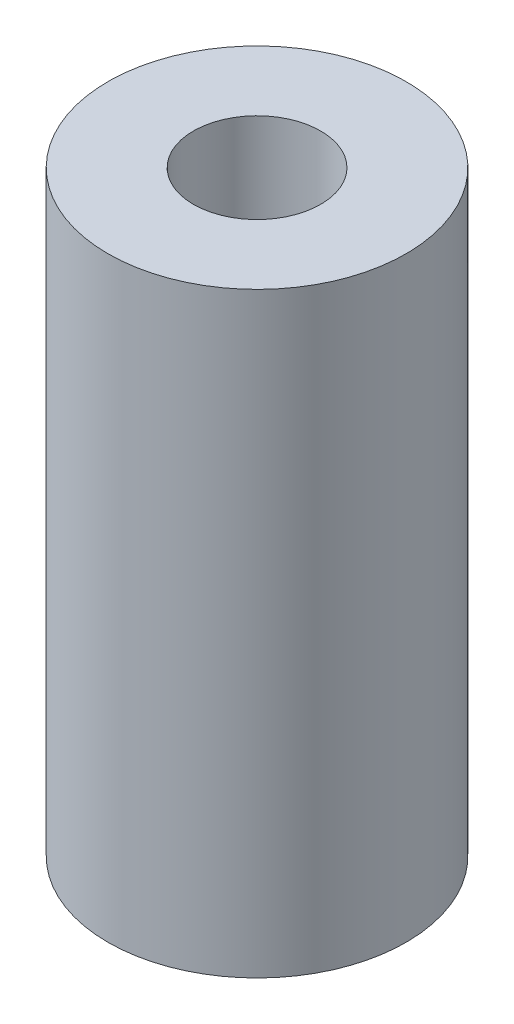
ISO-10303-21;
HEADER;
FILE_DESCRIPTION(('STEP AP214'),'2;1');
FILE_NAME('part.step','',(''),(''),'','','');
FILE_SCHEMA(('AUTOMOTIVE_DESIGN { 1 0 10303 214 1 1 1 1 }'));
ENDSEC;
DATA;
#1=APPLICATION_CONTEXT('core data for automotive mechanical design processes');
#2=APPLICATION_PROTOCOL_DEFINITION('international standard','automotive_design',2000,#1);
#3=PRODUCT_CONTEXT('',#1,'mechanical');
#4=PRODUCT('Part','Part','',(#3));
#5=PRODUCT_RELATED_PRODUCT_CATEGORY('part','',(#4));
#6=PRODUCT_DEFINITION_FORMATION('','',#4);
#7=PRODUCT_DEFINITION_CONTEXT('part definition',#1,'design');
#8=PRODUCT_DEFINITION('design','',#6,#7);
#9=PRODUCT_DEFINITION_SHAPE('','',#8);
#10=(LENGTH_UNIT() NAMED_UNIT(*) SI_UNIT(.MILLI.,.METRE.));
#11=(NAMED_UNIT(*) PLANE_ANGLE_UNIT() SI_UNIT($,.RADIAN.));
#12=(NAMED_UNIT(*) SI_UNIT($,.STERADIAN.) SOLID_ANGLE_UNIT());
#13=UNCERTAINTY_MEASURE_WITH_UNIT(LENGTH_MEASURE(1.E-05),#10,'distance_accuracy_value','');
#14=(GEOMETRIC_REPRESENTATION_CONTEXT(3) GLOBAL_UNCERTAINTY_ASSIGNED_CONTEXT((#13)) GLOBAL_UNIT_ASSIGNED_CONTEXT((#10,
#11,#12)) REPRESENTATION_CONTEXT('',''));
#15=CARTESIAN_POINT('',(0.,0.,0.));
#16=DIRECTION('',(0.,0.,1.));
#17=DIRECTION('',(1.,0.,0.));
#18=AXIS2_PLACEMENT_3D('',#15,#16,#17);
#19=CARTESIAN_POINT('',(0.,38.1,0.));
#20=DIRECTION('',(0.,1.,0.));
#21=DIRECTION('',(0.,0.,1.));
#22=AXIS2_PLACEMENT_3D('',#19,#20,#21);
#23=PLANE('',#22);
#24=CARTESIAN_POINT('',(0.,38.1,0.));
#25=DIRECTION('',(0.,1.,0.));
#26=DIRECTION('',(0.,0.,1.));
#27=AXIS2_PLACEMENT_3D('',#24,#25,#26);
#28=CIRCLE('',#27,9.525);
#29=CARTESIAN_POINT('',(0.,38.1,9.525));
#30=VERTEX_POINT('',#29);
#31=EDGE_CURVE('E10',#30,#30,#28,.T.);
#32=ORIENTED_EDGE('',*,*,#31,.T.);
#33=EDGE_LOOP('',(#32));
#34=FACE_BOUND('',#33,.T.);
#35=CARTESIAN_POINT('',(0.,38.1,0.));
#36=DIRECTION('',(0.,1.,0.));
#37=DIRECTION('',(0.,0.,1.));
#38=AXIS2_PLACEMENT_3D('',#35,#36,#37);
#39=CIRCLE('',#38,4.064);
#40=CARTESIAN_POINT('',(0.,38.1,4.064));
#41=VERTEX_POINT('',#40);
#42=EDGE_CURVE('E42',#41,#41,#39,.T.);
#43=ORIENTED_EDGE('',*,*,#42,.F.);
#44=EDGE_LOOP('',(#43));
#45=FACE_BOUND('',#44,.T.);
#46=ADVANCED_FACE('F31',(#34,#45),#23,.T.);
#47=CARTESIAN_POINT('',(0.,0.,0.));
#48=DIRECTION('',(0.,1.,0.));
#49=DIRECTION('',(0.,0.,1.));
#50=AXIS2_PLACEMENT_3D('',#47,#48,#49);
#51=PLANE('',#50);
#52=CARTESIAN_POINT('',(0.,0.,0.));
#53=DIRECTION('',(0.,1.,0.));
#54=DIRECTION('',(0.,0.,1.));
#55=AXIS2_PLACEMENT_3D('',#52,#53,#54);
#56=CIRCLE('',#55,9.525);
#57=CARTESIAN_POINT('',(0.,0.,9.525));
#58=VERTEX_POINT('',#57);
#59=EDGE_CURVE('E35',#58,#58,#56,.T.);
#60=ORIENTED_EDGE('',*,*,#59,.F.);
#61=EDGE_LOOP('',(#60));
#62=FACE_BOUND('',#61,.T.);
#63=CARTESIAN_POINT('',(0.,0.,0.));
#64=DIRECTION('',(0.,1.,0.));
#65=DIRECTION('',(0.,0.,1.));
#66=AXIS2_PLACEMENT_3D('',#63,#64,#65);
#67=CIRCLE('',#66,4.064);
#68=CARTESIAN_POINT('',(0.,0.,4.064));
#69=VERTEX_POINT('',#68);
#70=EDGE_CURVE('E44',#69,#69,#67,.T.);
#71=ORIENTED_EDGE('',*,*,#70,.T.);
#72=EDGE_LOOP('',(#71));
#73=FACE_BOUND('',#72,.T.);
#74=ADVANCED_FACE('F54',(#62,#73),#51,.F.);
#75=CARTESIAN_POINT('',(0.,38.1,0.));
#76=DIRECTION('',(0.,-1.,0.));
#77=DIRECTION('',(0.,0.,-1.));
#78=AXIS2_PLACEMENT_3D('',#75,#76,#77);
#79=CYLINDRICAL_SURFACE('',#78,9.525);
#80=ORIENTED_EDGE('',*,*,#31,.F.);
#81=EDGE_LOOP('',(#80));
#82=FACE_BOUND('',#81,.T.);
#83=ORIENTED_EDGE('',*,*,#59,.T.);
#84=EDGE_LOOP('',(#83));
#85=FACE_BOUND('',#84,.T.);
#86=ADVANCED_FACE('F33',(#82,#85),#79,.T.);
#87=CARTESIAN_POINT('',(0.,38.1,0.));
#88=DIRECTION('',(0.,-1.,0.));
#89=DIRECTION('',(0.,0.,-1.));
#90=AXIS2_PLACEMENT_3D('',#87,#88,#89);
#91=CYLINDRICAL_SURFACE('',#90,4.064);
#92=ORIENTED_EDGE('',*,*,#42,.T.);
#93=EDGE_LOOP('',(#92));
#94=FACE_BOUND('',#93,.T.);
#95=ORIENTED_EDGE('',*,*,#70,.F.);
#96=EDGE_LOOP('',(#95));
#97=FACE_BOUND('',#96,.T.);
#98=ADVANCED_FACE('F50',(#94,#97),#91,.F.);
#99=CLOSED_SHELL('',(#46,#74,#86,#98));
#100=MANIFOLD_SOLID_BREP('B2',#99);
#101=ADVANCED_BREP_SHAPE_REPRESENTATION('',(#18,#100),#14);
#102=SHAPE_DEFINITION_REPRESENTATION(#9,#101);
ENDSEC;
END-ISO-10303-21;
